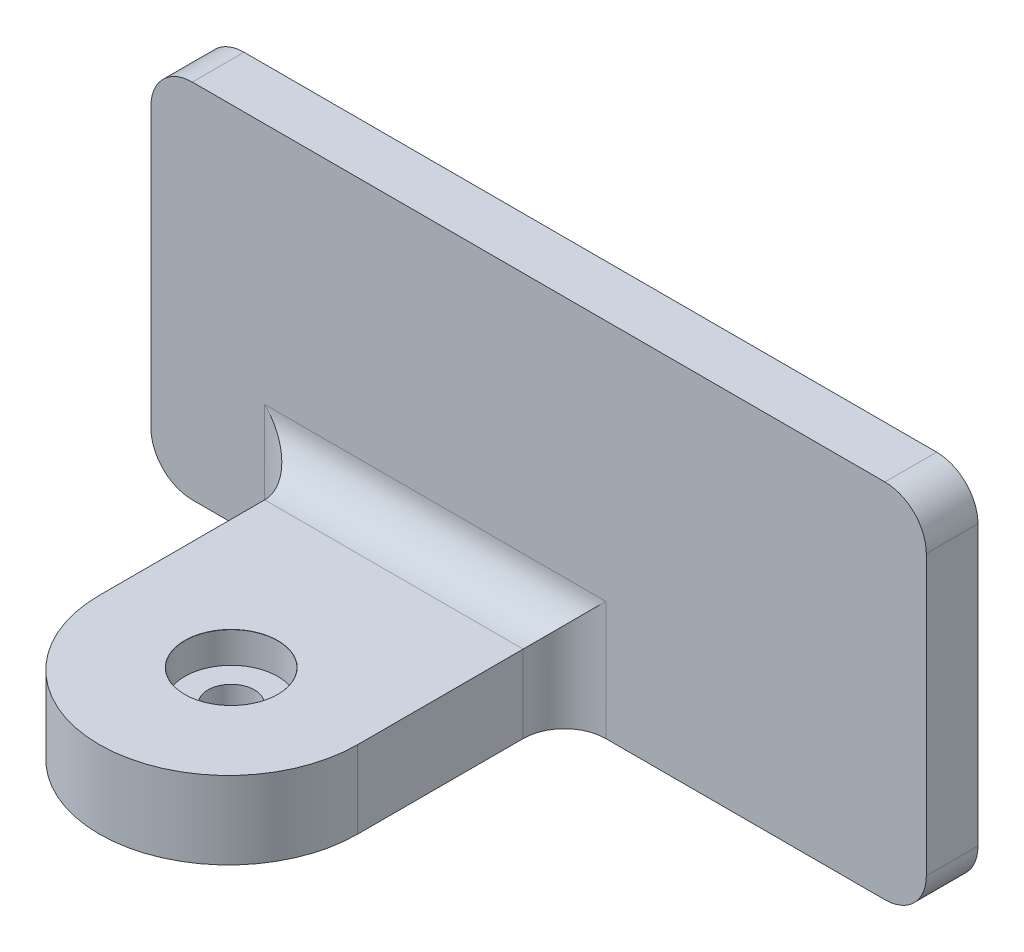
ISO-10303-21;
HEADER;
FILE_DESCRIPTION(('STEP AP214'),'2;1');
FILE_NAME('part.step','',(''),(''),'','','');
FILE_SCHEMA(('AUTOMOTIVE_DESIGN { 1 0 10303 214 1 1 1 1 }'));
ENDSEC;
DATA;
#1=APPLICATION_CONTEXT('core data for automotive mechanical design processes');
#2=APPLICATION_PROTOCOL_DEFINITION('international standard','automotive_design',2000,#1);
#3=PRODUCT_CONTEXT('',#1,'mechanical');
#4=PRODUCT('Part','Part','',(#3));
#5=PRODUCT_RELATED_PRODUCT_CATEGORY('part','',(#4));
#6=PRODUCT_DEFINITION_FORMATION('','',#4);
#7=PRODUCT_DEFINITION_CONTEXT('part definition',#1,'design');
#8=PRODUCT_DEFINITION('design','',#6,#7);
#9=PRODUCT_DEFINITION_SHAPE('','',#8);
#10=(LENGTH_UNIT() NAMED_UNIT(*) SI_UNIT(.MILLI.,.METRE.));
#11=(NAMED_UNIT(*) PLANE_ANGLE_UNIT() SI_UNIT($,.RADIAN.));
#12=(NAMED_UNIT(*) SI_UNIT($,.STERADIAN.) SOLID_ANGLE_UNIT());
#13=UNCERTAINTY_MEASURE_WITH_UNIT(LENGTH_MEASURE(1.E-05),#10,'distance_accuracy_value','');
#14=(GEOMETRIC_REPRESENTATION_CONTEXT(3) GLOBAL_UNCERTAINTY_ASSIGNED_CONTEXT((#13)) GLOBAL_UNIT_ASSIGNED_CONTEXT((#10,
#11,#12)) REPRESENTATION_CONTEXT('',''));
#15=CARTESIAN_POINT('',(0.,0.,0.));
#16=DIRECTION('',(0.,0.,1.));
#17=DIRECTION('',(1.,0.,0.));
#18=AXIS2_PLACEMENT_3D('',#15,#16,#17);
#19=CARTESIAN_POINT('',(150.,0.,10.));
#20=DIRECTION('',(0.,1.,0.));
#21=DIRECTION('',(-1.,0.,0.));
#22=AXIS2_PLACEMENT_3D('',#19,#20,#21);
#23=PLANE('',#22);
#24=CARTESIAN_POINT('',(54.8420286733037,0.,49.3138930316295));
#25=DIRECTION('',(0.,1.,0.));
#26=DIRECTION('',(0.,0.,1.));
#27=AXIS2_PLACEMENT_3D('',#24,#25,#26);
#28=CIRCLE('',#27,4.5);
#29=CARTESIAN_POINT('',(54.8420286733037,0.,53.8138930316295));
#30=VERTEX_POINT('',#29);
#31=EDGE_CURVE('E164',#30,#30,#28,.T.);
#32=ORIENTED_EDGE('',*,*,#31,.T.);
#33=EDGE_LOOP('',(#32));
#34=FACE_BOUND('',#33,.T.);
#35=DIRECTION('',(1.,0.,0.));
#36=VECTOR('',#35,1.);
#37=CARTESIAN_POINT('',(150.,0.,10.));
#38=LINE('',#37,#36);
#39=CARTESIAN_POINT('',(8.00000000000001,0.,10.));
#40=VERTEX_POINT('',#39);
#41=CARTESIAN_POINT('',(22.,0.,10.));
#42=VERTEX_POINT('',#41);
#43=EDGE_CURVE('E173',#40,#42,#38,.T.);
#44=ORIENTED_EDGE('',*,*,#43,.F.);
#45=DIRECTION('',(0.,0.,-1.));
#46=VECTOR('',#45,1.);
#47=CARTESIAN_POINT('',(8.00000000000001,0.,10.));
#48=LINE('',#47,#46);
#49=CARTESIAN_POINT('',(8.00000000000001,0.,0.));
#50=VERTEX_POINT('',#49);
#51=EDGE_CURVE('E245',#40,#50,#48,.T.);
#52=ORIENTED_EDGE('',*,*,#51,.T.);
#53=DIRECTION('',(1.,0.,0.));
#54=VECTOR('',#53,1.);
#55=CARTESIAN_POINT('',(150.,0.,0.));
#56=LINE('',#55,#54);
#57=CARTESIAN_POINT('',(142.,0.,0.));
#58=VERTEX_POINT('',#57);
#59=EDGE_CURVE('E171',#50,#58,#56,.T.);
#60=ORIENTED_EDGE('',*,*,#59,.T.);
#61=DIRECTION('',(0.,0.,-1.));
#62=VECTOR('',#61,1.);
#63=CARTESIAN_POINT('',(142.,0.,10.));
#64=LINE('',#63,#62);
#65=CARTESIAN_POINT('',(142.,0.,10.));
#66=VERTEX_POINT('',#65);
#67=EDGE_CURVE('E232',#58,#66,#64,.F.);
#68=ORIENTED_EDGE('',*,*,#67,.T.);
#69=CARTESIAN_POINT('',(88.,0.,10.));
#70=VERTEX_POINT('',#69);
#71=EDGE_CURVE('E176',#70,#66,#38,.T.);
#72=ORIENTED_EDGE('',*,*,#71,.F.);
#73=CARTESIAN_POINT('',(88.,0.,18.));
#74=DIRECTION('',(0.,1.,0.));
#75=DIRECTION('',(-1.,0.,0.));
#76=AXIS2_PLACEMENT_3D('',#73,#74,#75);
#77=CIRCLE('',#76,8.);
#78=CARTESIAN_POINT('',(80.,0.,18.));
#79=VERTEX_POINT('',#78);
#80=EDGE_CURVE('E197',#70,#79,#77,.T.);
#81=ORIENTED_EDGE('',*,*,#80,.T.);
#82=DIRECTION('',(0.,0.,1.));
#83=VECTOR('',#82,1.);
#84=CARTESIAN_POINT('',(80.,0.,50.));
#85=LINE('',#84,#83);
#86=CARTESIAN_POINT('',(80.,0.,50.));
#87=VERTEX_POINT('',#86);
#88=EDGE_CURVE('E160',#79,#87,#85,.T.);
#89=ORIENTED_EDGE('',*,*,#88,.T.);
#90=CARTESIAN_POINT('',(55.,0.,50.));
#91=DIRECTION('',(0.,-1.,0.));
#92=DIRECTION('',(1.,0.,0.));
#93=AXIS2_PLACEMENT_3D('',#90,#91,#92);
#94=CIRCLE('',#93,25.);
#95=CARTESIAN_POINT('',(30.,0.,50.));
#96=VERTEX_POINT('',#95);
#97=EDGE_CURVE('E168',#87,#96,#94,.T.);
#98=ORIENTED_EDGE('',*,*,#97,.T.);
#99=DIRECTION('',(0.,0.,-1.));
#100=VECTOR('',#99,1.);
#101=CARTESIAN_POINT('',(30.,0.,50.));
#102=LINE('',#101,#100);
#103=CARTESIAN_POINT('',(30.,0.,18.));
#104=VERTEX_POINT('',#103);
#105=EDGE_CURVE('E140',#96,#104,#102,.T.);
#106=ORIENTED_EDGE('',*,*,#105,.T.);
#107=CARTESIAN_POINT('',(22.,0.,18.));
#108=DIRECTION('',(0.,1.,0.));
#109=DIRECTION('',(-1.,0.,0.));
#110=AXIS2_PLACEMENT_3D('',#107,#108,#109);
#111=CIRCLE('',#110,8.);
#112=EDGE_CURVE('E212',#104,#42,#111,.T.);
#113=ORIENTED_EDGE('',*,*,#112,.T.);
#114=EDGE_LOOP('',(#44,#52,#60,#68,#72,#81,#89,#98,#106,#113));
#115=FACE_BOUND('',#114,.T.);
#116=ADVANCED_FACE('F33',(#34,#115),#23,.F.);
#117=CARTESIAN_POINT('',(150.,70.,10.));
#118=DIRECTION('',(-1.,0.,0.));
#119=DIRECTION('',(0.,0.,1.));
#120=AXIS2_PLACEMENT_3D('',#117,#118,#119);
#121=PLANE('',#120);
#122=DIRECTION('',(0.,1.,0.));
#123=VECTOR('',#122,1.);
#124=CARTESIAN_POINT('',(150.,70.,10.));
#125=LINE('',#124,#123);
#126=CARTESIAN_POINT('',(150.,8.,10.));
#127=VERTEX_POINT('',#126);
#128=CARTESIAN_POINT('',(150.,62.,10.));
#129=VERTEX_POINT('',#128);
#130=EDGE_CURVE('E175',#127,#129,#125,.T.);
#131=ORIENTED_EDGE('',*,*,#130,.F.);
#132=DIRECTION('',(0.,0.,-1.));
#133=VECTOR('',#132,1.);
#134=CARTESIAN_POINT('',(150.,8.,10.));
#135=LINE('',#134,#133);
#136=CARTESIAN_POINT('',(150.,8.,0.));
#137=VERTEX_POINT('',#136);
#138=EDGE_CURVE('E226',#127,#137,#135,.T.);
#139=ORIENTED_EDGE('',*,*,#138,.T.);
#140=DIRECTION('',(0.,1.,0.));
#141=VECTOR('',#140,1.);
#142=CARTESIAN_POINT('',(150.,70.,0.));
#143=LINE('',#142,#141);
#144=CARTESIAN_POINT('',(150.,62.,0.));
#145=VERTEX_POINT('',#144);
#146=EDGE_CURVE('E185',#137,#145,#143,.T.);
#147=ORIENTED_EDGE('',*,*,#146,.T.);
#148=DIRECTION('',(0.,0.,-1.));
#149=VECTOR('',#148,1.);
#150=CARTESIAN_POINT('',(150.,62.,10.));
#151=LINE('',#150,#149);
#152=EDGE_CURVE('E221',#145,#129,#151,.F.);
#153=ORIENTED_EDGE('',*,*,#152,.T.);
#154=EDGE_LOOP('',(#131,#139,#147,#153));
#155=FACE_BOUND('',#154,.T.);
#156=ADVANCED_FACE('F289',(#155),#121,.F.);
#157=CARTESIAN_POINT('',(0.,70.,10.));
#158=DIRECTION('',(0.,-1.,0.));
#159=DIRECTION('',(0.,0.,-1.));
#160=AXIS2_PLACEMENT_3D('',#157,#158,#159);
#161=PLANE('',#160);
#162=DIRECTION('',(-1.,0.,0.));
#163=VECTOR('',#162,1.);
#164=CARTESIAN_POINT('',(0.,70.,0.));
#165=LINE('',#164,#163);
#166=CARTESIAN_POINT('',(142.,70.,0.));
#167=VERTEX_POINT('',#166);
#168=CARTESIAN_POINT('',(8.,70.,0.));
#169=VERTEX_POINT('',#168);
#170=EDGE_CURVE('E187',#167,#169,#165,.T.);
#171=ORIENTED_EDGE('',*,*,#170,.T.);
#172=DIRECTION('',(0.,0.,-1.));
#173=VECTOR('',#172,1.);
#174=CARTESIAN_POINT('',(8.,70.,10.));
#175=LINE('',#174,#173);
#176=CARTESIAN_POINT('',(8.,70.,10.));
#177=VERTEX_POINT('',#176);
#178=EDGE_CURVE('E241',#169,#177,#175,.F.);
#179=ORIENTED_EDGE('',*,*,#178,.T.);
#180=DIRECTION('',(-1.,0.,0.));
#181=VECTOR('',#180,1.);
#182=CARTESIAN_POINT('',(0.,70.,10.));
#183=LINE('',#182,#181);
#184=CARTESIAN_POINT('',(142.,70.,10.));
#185=VERTEX_POINT('',#184);
#186=EDGE_CURVE('E178',#185,#177,#183,.T.);
#187=ORIENTED_EDGE('',*,*,#186,.F.);
#188=DIRECTION('',(0.,0.,-1.));
#189=VECTOR('',#188,1.);
#190=CARTESIAN_POINT('',(142.,70.,10.));
#191=LINE('',#190,#189);
#192=EDGE_CURVE('E215',#185,#167,#191,.T.);
#193=ORIENTED_EDGE('',*,*,#192,.T.);
#194=EDGE_LOOP('',(#171,#179,#187,#193));
#195=FACE_BOUND('',#194,.T.);
#196=ADVANCED_FACE('F296',(#195),#161,.F.);
#197=CARTESIAN_POINT('',(0.,0.,10.));
#198=DIRECTION('',(1.,0.,0.));
#199=DIRECTION('',(0.,0.,-1.));
#200=AXIS2_PLACEMENT_3D('',#197,#198,#199);
#201=PLANE('',#200);
#202=DIRECTION('',(0.,-1.,0.));
#203=VECTOR('',#202,1.);
#204=CARTESIAN_POINT('',(0.,0.,0.));
#205=LINE('',#204,#203);
#206=CARTESIAN_POINT('',(0.,62.,0.));
#207=VERTEX_POINT('',#206);
#208=CARTESIAN_POINT('',(0.,8.,0.));
#209=VERTEX_POINT('',#208);
#210=EDGE_CURVE('E190',#207,#209,#205,.T.);
#211=ORIENTED_EDGE('',*,*,#210,.T.);
#212=DIRECTION('',(0.,0.,-1.));
#213=VECTOR('',#212,1.);
#214=CARTESIAN_POINT('',(0.,8.,10.));
#215=LINE('',#214,#213);
#216=CARTESIAN_POINT('',(0.,8.,10.));
#217=VERTEX_POINT('',#216);
#218=EDGE_CURVE('E41',#209,#217,#215,.F.);
#219=ORIENTED_EDGE('',*,*,#218,.T.);
#220=DIRECTION('',(0.,-1.,0.));
#221=VECTOR('',#220,1.);
#222=CARTESIAN_POINT('',(0.,0.,10.));
#223=LINE('',#222,#221);
#224=CARTESIAN_POINT('',(0.,62.,10.));
#225=VERTEX_POINT('',#224);
#226=EDGE_CURVE('E181',#225,#217,#223,.T.);
#227=ORIENTED_EDGE('',*,*,#226,.F.);
#228=DIRECTION('',(0.,0.,-1.));
#229=VECTOR('',#228,1.);
#230=CARTESIAN_POINT('',(0.,62.,10.));
#231=LINE('',#230,#229);
#232=EDGE_CURVE('E236',#225,#207,#231,.T.);
#233=ORIENTED_EDGE('',*,*,#232,.T.);
#234=EDGE_LOOP('',(#211,#219,#227,#233));
#235=FACE_BOUND('',#234,.T.);
#236=ADVANCED_FACE('F334',(#235),#201,.F.);
#237=CARTESIAN_POINT('',(0.,0.,10.));
#238=DIRECTION('',(0.,0.,-1.));
#239=DIRECTION('',(-1.,0.,0.));
#240=AXIS2_PLACEMENT_3D('',#237,#238,#239);
#241=PLANE('',#240);
#242=ORIENTED_EDGE('',*,*,#226,.T.);
#243=CARTESIAN_POINT('',(8.00000000000001,8.,10.));
#244=DIRECTION('',(0.,0.,-1.));
#245=DIRECTION('',(-1.,0.,0.));
#246=AXIS2_PLACEMENT_3D('',#243,#244,#245);
#247=CIRCLE('',#246,8.);
#248=EDGE_CURVE('E11',#217,#40,#247,.F.);
#249=ORIENTED_EDGE('',*,*,#248,.T.);
#250=ORIENTED_EDGE('',*,*,#43,.T.);
#251=DIRECTION('',(0.,1.,0.));
#252=VECTOR('',#251,1.);
#253=CARTESIAN_POINT('',(22.,0.,10.));
#254=LINE('',#253,#252);
#255=CARTESIAN_POINT('',(22.,23.,10.));
#256=VERTEX_POINT('',#255);
#257=EDGE_CURVE('E205',#42,#256,#254,.T.);
#258=ORIENTED_EDGE('',*,*,#257,.T.);
#259=DIRECTION('',(-1.,0.,0.));
#260=VECTOR('',#259,1.);
#261=CARTESIAN_POINT('',(88.,23.,10.));
#262=LINE('',#261,#260);
#263=CARTESIAN_POINT('',(88.,23.,10.));
#264=VERTEX_POINT('',#263);
#265=EDGE_CURVE('E200',#256,#264,#262,.F.);
#266=ORIENTED_EDGE('',*,*,#265,.T.);
#267=DIRECTION('',(0.,-1.,0.));
#268=VECTOR('',#267,1.);
#269=CARTESIAN_POINT('',(88.,0.,10.));
#270=LINE('',#269,#268);
#271=EDGE_CURVE('E183',#264,#70,#270,.T.);
#272=ORIENTED_EDGE('',*,*,#271,.T.);
#273=ORIENTED_EDGE('',*,*,#71,.T.);
#274=CARTESIAN_POINT('',(142.,8.,10.));
#275=DIRECTION('',(0.,0.,-1.));
#276=DIRECTION('',(-1.,0.,0.));
#277=AXIS2_PLACEMENT_3D('',#274,#275,#276);
#278=CIRCLE('',#277,8.);
#279=EDGE_CURVE('E234',#66,#127,#278,.F.);
#280=ORIENTED_EDGE('',*,*,#279,.T.);
#281=ORIENTED_EDGE('',*,*,#130,.T.);
#282=CARTESIAN_POINT('',(142.,62.,10.));
#283=DIRECTION('',(0.,0.,-1.));
#284=DIRECTION('',(-1.,0.,0.));
#285=AXIS2_PLACEMENT_3D('',#282,#283,#284);
#286=CIRCLE('',#285,8.);
#287=EDGE_CURVE('E224',#129,#185,#286,.F.);
#288=ORIENTED_EDGE('',*,*,#287,.T.);
#289=ORIENTED_EDGE('',*,*,#186,.T.);
#290=CARTESIAN_POINT('',(8.,62.,10.));
#291=DIRECTION('',(0.,0.,-1.));
#292=DIRECTION('',(-1.,0.,0.));
#293=AXIS2_PLACEMENT_3D('',#290,#291,#292);
#294=CIRCLE('',#293,8.);
#295=EDGE_CURVE('E243',#177,#225,#294,.F.);
#296=ORIENTED_EDGE('',*,*,#295,.T.);
#297=EDGE_LOOP('',(#242,#249,#250,#258,#266,#272,#273,#280,#281,#288,#289,#296));
#298=FACE_BOUND('',#297,.T.);
#299=ADVANCED_FACE('F263',(#298),#241,.F.);
#300=CARTESIAN_POINT('',(0.,0.,0.));
#301=DIRECTION('',(0.,0.,-1.));
#302=DIRECTION('',(-1.,0.,0.));
#303=AXIS2_PLACEMENT_3D('',#300,#301,#302);
#304=PLANE('',#303);
#305=ORIENTED_EDGE('',*,*,#59,.F.);
#306=CARTESIAN_POINT('',(8.00000000000001,8.,0.));
#307=DIRECTION('',(0.,0.,-1.));
#308=DIRECTION('',(-1.,0.,0.));
#309=AXIS2_PLACEMENT_3D('',#306,#307,#308);
#310=CIRCLE('',#309,8.);
#311=EDGE_CURVE('E55',#50,#209,#310,.T.);
#312=ORIENTED_EDGE('',*,*,#311,.T.);
#313=ORIENTED_EDGE('',*,*,#210,.F.);
#314=CARTESIAN_POINT('',(8.,62.,0.));
#315=DIRECTION('',(0.,0.,-1.));
#316=DIRECTION('',(-1.,0.,0.));
#317=AXIS2_PLACEMENT_3D('',#314,#315,#316);
#318=CIRCLE('',#317,8.);
#319=EDGE_CURVE('E239',#207,#169,#318,.T.);
#320=ORIENTED_EDGE('',*,*,#319,.T.);
#321=ORIENTED_EDGE('',*,*,#170,.F.);
#322=CARTESIAN_POINT('',(142.,62.,0.));
#323=DIRECTION('',(0.,0.,-1.));
#324=DIRECTION('',(-1.,0.,0.));
#325=AXIS2_PLACEMENT_3D('',#322,#323,#324);
#326=CIRCLE('',#325,8.);
#327=EDGE_CURVE('E218',#167,#145,#326,.T.);
#328=ORIENTED_EDGE('',*,*,#327,.T.);
#329=ORIENTED_EDGE('',*,*,#146,.F.);
#330=CARTESIAN_POINT('',(142.,8.,0.));
#331=DIRECTION('',(0.,0.,-1.));
#332=DIRECTION('',(-1.,0.,0.));
#333=AXIS2_PLACEMENT_3D('',#330,#331,#332);
#334=CIRCLE('',#333,8.);
#335=EDGE_CURVE('E229',#137,#58,#334,.T.);
#336=ORIENTED_EDGE('',*,*,#335,.T.);
#337=EDGE_LOOP('',(#305,#312,#313,#320,#321,#328,#329,#336));
#338=FACE_BOUND('',#337,.T.);
#339=ADVANCED_FACE('F253',(#338),#304,.T.);
#340=CARTESIAN_POINT('',(80.,15.,50.));
#341=DIRECTION('',(1.,0.,0.));
#342=DIRECTION('',(0.,1.,0.));
#343=AXIS2_PLACEMENT_3D('',#340,#341,#342);
#344=PLANE('',#343);
#345=ORIENTED_EDGE('',*,*,#88,.F.);
#346=DIRECTION('',(0.,-1.,0.));
#347=VECTOR('',#346,1.);
#348=CARTESIAN_POINT('',(80.,15.,18.));
#349=LINE('',#348,#347);
#350=CARTESIAN_POINT('',(80.,15.,18.));
#351=VERTEX_POINT('',#350);
#352=EDGE_CURVE('E194',#79,#351,#349,.F.);
#353=ORIENTED_EDGE('',*,*,#352,.T.);
#354=DIRECTION('',(0.,0.,1.));
#355=VECTOR('',#354,1.);
#356=CARTESIAN_POINT('',(80.,15.,50.));
#357=LINE('',#356,#355);
#358=CARTESIAN_POINT('',(80.,15.,50.));
#359=VERTEX_POINT('',#358);
#360=EDGE_CURVE('E146',#351,#359,#357,.T.);
#361=ORIENTED_EDGE('',*,*,#360,.T.);
#362=DIRECTION('',(0.,-1.,0.));
#363=VECTOR('',#362,1.);
#364=CARTESIAN_POINT('',(80.,15.,50.));
#365=LINE('',#364,#363);
#366=EDGE_CURVE('E145',#359,#87,#365,.T.);
#367=ORIENTED_EDGE('',*,*,#366,.T.);
#368=EDGE_LOOP('',(#345,#353,#361,#367));
#369=FACE_BOUND('',#368,.T.);
#370=ADVANCED_FACE('F271',(#369),#344,.T.);
#371=CARTESIAN_POINT('',(30.,15.,50.));
#372=DIRECTION('',(-1.,0.,0.));
#373=DIRECTION('',(0.,0.,1.));
#374=AXIS2_PLACEMENT_3D('',#371,#372,#373);
#375=PLANE('',#374);
#376=DIRECTION('',(0.,0.,-1.));
#377=VECTOR('',#376,1.);
#378=CARTESIAN_POINT('',(30.,15.,50.));
#379=LINE('',#378,#377);
#380=CARTESIAN_POINT('',(30.,15.,50.));
#381=VERTEX_POINT('',#380);
#382=CARTESIAN_POINT('',(30.,15.,18.));
#383=VERTEX_POINT('',#382);
#384=EDGE_CURVE('E137',#381,#383,#379,.T.);
#385=ORIENTED_EDGE('',*,*,#384,.T.);
#386=DIRECTION('',(0.,1.,0.));
#387=VECTOR('',#386,1.);
#388=CARTESIAN_POINT('',(30.,15.,18.));
#389=LINE('',#388,#387);
#390=EDGE_CURVE('E208',#383,#104,#389,.F.);
#391=ORIENTED_EDGE('',*,*,#390,.T.);
#392=ORIENTED_EDGE('',*,*,#105,.F.);
#393=DIRECTION('',(0.,-1.,0.));
#394=VECTOR('',#393,1.);
#395=CARTESIAN_POINT('',(30.,15.,50.));
#396=LINE('',#395,#394);
#397=EDGE_CURVE('E134',#381,#96,#396,.T.);
#398=ORIENTED_EDGE('',*,*,#397,.F.);
#399=EDGE_LOOP('',(#385,#391,#392,#398));
#400=FACE_BOUND('',#399,.T.);
#401=ADVANCED_FACE('F136',(#400),#375,.T.);
#402=CARTESIAN_POINT('',(55.,15.,50.));
#403=DIRECTION('',(0.,-1.,0.));
#404=DIRECTION('',(1.,0.,0.));
#405=AXIS2_PLACEMENT_3D('',#402,#403,#404);
#406=PLANE('',#405);
#407=CARTESIAN_POINT('',(54.8420286733037,15.,49.3138930316295));
#408=DIRECTION('',(0.,1.,0.));
#409=DIRECTION('',(0.,0.,1.));
#410=AXIS2_PLACEMENT_3D('',#407,#408,#409);
#411=CIRCLE('',#410,9.02500000000001);
#412=CARTESIAN_POINT('',(54.8420286733037,15.,58.3388930316295));
#413=VERTEX_POINT('',#412);
#414=EDGE_CURVE('E480',#413,#413,#411,.T.);
#415=ORIENTED_EDGE('',*,*,#414,.F.);
#416=EDGE_LOOP('',(#415));
#417=FACE_BOUND('',#416,.T.);
#418=ORIENTED_EDGE('',*,*,#360,.F.);
#419=DIRECTION('',(-1.,0.,0.));
#420=VECTOR('',#419,1.);
#421=CARTESIAN_POINT('',(30.,15.,18.));
#422=LINE('',#421,#420);
#423=EDGE_CURVE('E155',#351,#383,#422,.T.);
#424=ORIENTED_EDGE('',*,*,#423,.T.);
#425=ORIENTED_EDGE('',*,*,#384,.F.);
#426=CARTESIAN_POINT('',(55.,15.,50.));
#427=DIRECTION('',(0.,-1.,0.));
#428=DIRECTION('',(1.,0.,0.));
#429=AXIS2_PLACEMENT_3D('',#426,#427,#428);
#430=CIRCLE('',#429,25.);
#431=EDGE_CURVE('E153',#359,#381,#430,.T.);
#432=ORIENTED_EDGE('',*,*,#431,.F.);
#433=EDGE_LOOP('',(#418,#424,#425,#432));
#434=FACE_BOUND('',#433,.T.);
#435=ADVANCED_FACE('F152',(#417,#434),#406,.F.);
#436=CARTESIAN_POINT('',(55.,15.,50.));
#437=DIRECTION('',(0.,-1.,0.));
#438=DIRECTION('',(1.,0.,0.));
#439=AXIS2_PLACEMENT_3D('',#436,#437,#438);
#440=CYLINDRICAL_SURFACE('',#439,25.);
#441=ORIENTED_EDGE('',*,*,#97,.F.);
#442=ORIENTED_EDGE('',*,*,#366,.F.);
#443=ORIENTED_EDGE('',*,*,#431,.T.);
#444=ORIENTED_EDGE('',*,*,#397,.T.);
#445=EDGE_LOOP('',(#441,#442,#443,#444));
#446=FACE_BOUND('',#445,.T.);
#447=ADVANCED_FACE('F158',(#446),#440,.T.);
#448=CARTESIAN_POINT('',(88.,0.,18.));
#449=DIRECTION('',(0.,-1.,0.));
#450=DIRECTION('',(1.,0.,0.));
#451=AXIS2_PLACEMENT_3D('',#448,#449,#450);
#452=CYLINDRICAL_SURFACE('',#451,8.);
#453=ORIENTED_EDGE('',*,*,#271,.F.);
#454=CARTESIAN_POINT('',(88.,23.,18.));
#455=DIRECTION('',(0.707106781186547,-0.707106781186547,0.));
#456=DIRECTION('',(-0.707106781186547,-0.707106781186547,0.));
#457=AXIS2_PLACEMENT_3D('',#454,#455,#456);
#458=ELLIPSE('',#457,11.3137084989848,8.);
#459=EDGE_CURVE('E203',#264,#351,#458,.F.);
#460=ORIENTED_EDGE('',*,*,#459,.T.);
#461=ORIENTED_EDGE('',*,*,#352,.F.);
#462=ORIENTED_EDGE('',*,*,#80,.F.);
#463=EDGE_LOOP('',(#453,#460,#461,#462));
#464=FACE_BOUND('',#463,.T.);
#465=ADVANCED_FACE('F267',(#464),#452,.F.);
#466=CARTESIAN_POINT('',(55.,23.,18.));
#467=DIRECTION('',(1.,0.,0.));
#468=DIRECTION('',(0.,1.,0.));
#469=AXIS2_PLACEMENT_3D('',#466,#467,#468);
#470=CYLINDRICAL_SURFACE('',#469,8.);
#471=ORIENTED_EDGE('',*,*,#459,.F.);
#472=ORIENTED_EDGE('',*,*,#265,.F.);
#473=CARTESIAN_POINT('',(22.,23.,18.));
#474=DIRECTION('',(0.707106781186547,0.707106781186547,0.));
#475=DIRECTION('',(0.707106781186547,-0.707106781186547,0.));
#476=AXIS2_PLACEMENT_3D('',#473,#474,#475);
#477=ELLIPSE('',#476,11.3137084989848,8.);
#478=EDGE_CURVE('E210',#256,#383,#477,.F.);
#479=ORIENTED_EDGE('',*,*,#478,.T.);
#480=ORIENTED_EDGE('',*,*,#423,.F.);
#481=EDGE_LOOP('',(#471,#472,#479,#480));
#482=FACE_BOUND('',#481,.T.);
#483=ADVANCED_FACE('F304',(#482),#470,.F.);
#484=CARTESIAN_POINT('',(22.,0.,18.));
#485=DIRECTION('',(0.,1.,0.));
#486=DIRECTION('',(-1.,0.,0.));
#487=AXIS2_PLACEMENT_3D('',#484,#485,#486);
#488=CYLINDRICAL_SURFACE('',#487,8.);
#489=ORIENTED_EDGE('',*,*,#112,.F.);
#490=ORIENTED_EDGE('',*,*,#390,.F.);
#491=ORIENTED_EDGE('',*,*,#478,.F.);
#492=ORIENTED_EDGE('',*,*,#257,.F.);
#493=EDGE_LOOP('',(#489,#490,#491,#492));
#494=FACE_BOUND('',#493,.T.);
#495=ADVANCED_FACE('F275',(#494),#488,.F.);
#496=CARTESIAN_POINT('',(142.,62.,10.));
#497=DIRECTION('',(0.,0.,-1.));
#498=DIRECTION('',(-1.,0.,0.));
#499=AXIS2_PLACEMENT_3D('',#496,#497,#498);
#500=CYLINDRICAL_SURFACE('',#499,8.);
#501=ORIENTED_EDGE('',*,*,#287,.F.);
#502=ORIENTED_EDGE('',*,*,#152,.F.);
#503=ORIENTED_EDGE('',*,*,#327,.F.);
#504=ORIENTED_EDGE('',*,*,#192,.F.);
#505=EDGE_LOOP('',(#501,#502,#503,#504));
#506=FACE_BOUND('',#505,.T.);
#507=ADVANCED_FACE('F310',(#506),#500,.T.);
#508=CARTESIAN_POINT('',(142.,8.,10.));
#509=DIRECTION('',(0.,0.,-1.));
#510=DIRECTION('',(-1.,0.,0.));
#511=AXIS2_PLACEMENT_3D('',#508,#509,#510);
#512=CYLINDRICAL_SURFACE('',#511,8.);
#513=ORIENTED_EDGE('',*,*,#279,.F.);
#514=ORIENTED_EDGE('',*,*,#67,.F.);
#515=ORIENTED_EDGE('',*,*,#335,.F.);
#516=ORIENTED_EDGE('',*,*,#138,.F.);
#517=EDGE_LOOP('',(#513,#514,#515,#516));
#518=FACE_BOUND('',#517,.T.);
#519=ADVANCED_FACE('F259',(#518),#512,.T.);
#520=CARTESIAN_POINT('',(8.,62.,10.));
#521=DIRECTION('',(0.,0.,-1.));
#522=DIRECTION('',(-1.,0.,0.));
#523=AXIS2_PLACEMENT_3D('',#520,#521,#522);
#524=CYLINDRICAL_SURFACE('',#523,8.);
#525=ORIENTED_EDGE('',*,*,#295,.F.);
#526=ORIENTED_EDGE('',*,*,#178,.F.);
#527=ORIENTED_EDGE('',*,*,#319,.F.);
#528=ORIENTED_EDGE('',*,*,#232,.F.);
#529=EDGE_LOOP('',(#525,#526,#527,#528));
#530=FACE_BOUND('',#529,.T.);
#531=ADVANCED_FACE('F279',(#530),#524,.T.);
#532=CARTESIAN_POINT('',(8.00000000000001,8.,10.));
#533=DIRECTION('',(0.,0.,-1.));
#534=DIRECTION('',(-1.,0.,0.));
#535=AXIS2_PLACEMENT_3D('',#532,#533,#534);
#536=CYLINDRICAL_SURFACE('',#535,8.);
#537=ORIENTED_EDGE('',*,*,#248,.F.);
#538=ORIENTED_EDGE('',*,*,#218,.F.);
#539=ORIENTED_EDGE('',*,*,#311,.F.);
#540=ORIENTED_EDGE('',*,*,#51,.F.);
#541=EDGE_LOOP('',(#537,#538,#539,#540));
#542=FACE_BOUND('',#541,.T.);
#543=ADVANCED_FACE('F35',(#542),#536,.T.);
#544=CARTESIAN_POINT('',(54.8420286733037,15.,49.3138930316295));
#545=DIRECTION('',(0.,1.,0.));
#546=DIRECTION('',(0.,0.,1.));
#547=AXIS2_PLACEMENT_3D('',#544,#545,#546);
#548=CYLINDRICAL_SURFACE('',#547,4.5);
#549=ORIENTED_EDGE('',*,*,#31,.F.);
#550=EDGE_LOOP('',(#549));
#551=FACE_BOUND('',#550,.T.);
#552=CARTESIAN_POINT('',(54.8420286733037,9.,49.3138930316295));
#553=DIRECTION('',(0.,1.,0.));
#554=DIRECTION('',(0.,0.,1.));
#555=AXIS2_PLACEMENT_3D('',#552,#553,#554);
#556=CIRCLE('',#555,4.5);
#557=CARTESIAN_POINT('',(54.8420286733037,9.,53.8138930316295));
#558=VERTEX_POINT('',#557);
#559=EDGE_CURVE('E488',#558,#558,#556,.T.);
#560=ORIENTED_EDGE('',*,*,#559,.T.);
#561=EDGE_LOOP('',(#560));
#562=FACE_BOUND('',#561,.T.);
#563=ADVANCED_FACE('F278',(#551,#562),#548,.F.);
#564=CARTESIAN_POINT('',(63.8420286733037,9.,49.3138930316295));
#565=DIRECTION('',(0.,-1.,0.));
#566=DIRECTION('',(0.,0.,-1.));
#567=AXIS2_PLACEMENT_3D('',#564,#565,#566);
#568=PLANE('',#567);
#569=ORIENTED_EDGE('',*,*,#559,.F.);
#570=EDGE_LOOP('',(#569));
#571=FACE_BOUND('',#570,.T.);
#572=CARTESIAN_POINT('',(54.8420286733037,9.,49.3138930316295));
#573=DIRECTION('',(0.,1.,0.));
#574=DIRECTION('',(0.,0.,1.));
#575=AXIS2_PLACEMENT_3D('',#572,#573,#574);
#576=CIRCLE('',#575,8.99999999999999);
#577=CARTESIAN_POINT('',(54.8420286733037,9.,58.3138930316295));
#578=VERTEX_POINT('',#577);
#579=EDGE_CURVE('E484',#578,#578,#576,.T.);
#580=ORIENTED_EDGE('',*,*,#579,.T.);
#581=EDGE_LOOP('',(#580));
#582=FACE_BOUND('',#581,.T.);
#583=ADVANCED_FACE('F284',(#571,#582),#568,.F.);
#584=CARTESIAN_POINT('',(54.8420286733037,15.,49.3138930316295));
#585=DIRECTION('',(0.,1.,0.));
#586=DIRECTION('',(0.,0.,1.));
#587=AXIS2_PLACEMENT_3D('',#584,#585,#586);
#588=CYLINDRICAL_SURFACE('',#587,9.);
#589=ORIENTED_EDGE('',*,*,#579,.F.);
#590=EDGE_LOOP('',(#589));
#591=FACE_BOUND('',#590,.T.);
#592=CARTESIAN_POINT('',(54.8420286733037,14.9790225092206,49.3138930316295));
#593=DIRECTION('',(0.,1.,0.));
#594=DIRECTION('',(0.,0.,1.));
#595=AXIS2_PLACEMENT_3D('',#592,#593,#594);
#596=CIRCLE('',#595,9.00000000000001);
#597=CARTESIAN_POINT('',(54.8420286733037,14.9790225092206,58.3138930316296));
#598=VERTEX_POINT('',#597);
#599=EDGE_CURVE('E481',#598,#598,#596,.T.);
#600=ORIENTED_EDGE('',*,*,#599,.T.);
#601=EDGE_LOOP('',(#600));
#602=FACE_BOUND('',#601,.T.);
#603=ADVANCED_FACE('F374',(#591,#602),#588,.F.);
#604=CARTESIAN_POINT('',(54.8420286733037,15.,49.3138930316295));
#605=DIRECTION('',(0.,1.,0.));
#606=DIRECTION('',(0.,0.,1.));
#607=AXIS2_PLACEMENT_3D('',#604,#605,#606);
#608=CONICAL_SURFACE('',#607,9.02500000000001,0.872664625997172);
#609=ORIENTED_EDGE('',*,*,#599,.F.);
#610=EDGE_LOOP('',(#609));
#611=FACE_BOUND('',#610,.T.);
#612=ORIENTED_EDGE('',*,*,#414,.T.);
#613=EDGE_LOOP('',(#612));
#614=FACE_BOUND('',#613,.T.);
#615=ADVANCED_FACE('F383',(#611,#614),#608,.F.);
#616=CLOSED_SHELL('',(#116,#156,#196,#236,#299,#339,#370,#401,#435,#447,#465,#483,#495,#507,
#519,#531,#543,#563,#583,#603,#615));
#617=MANIFOLD_SOLID_BREP('B2',#616);
#618=ADVANCED_BREP_SHAPE_REPRESENTATION('',(#18,#617),#14);
#619=SHAPE_DEFINITION_REPRESENTATION(#9,#618);
ENDSEC;
END-ISO-10303-21;
